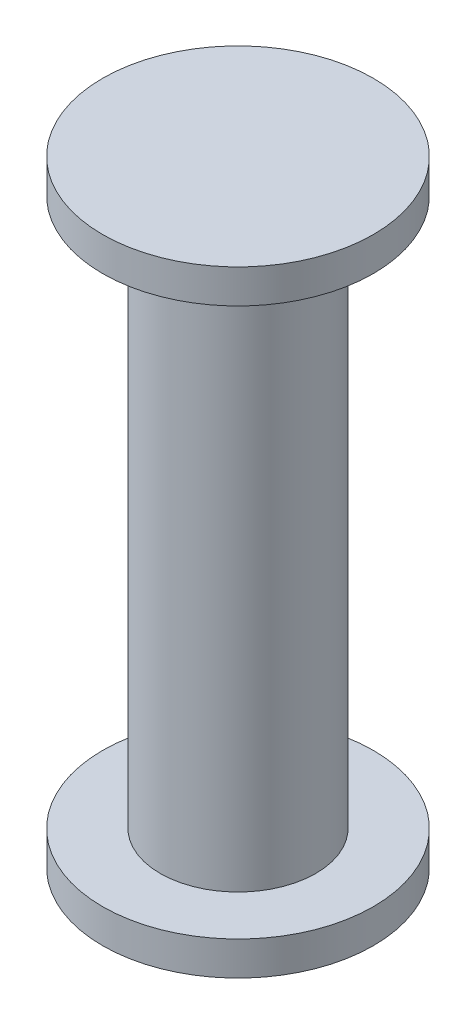
ISO-10303-21;
HEADER;
FILE_DESCRIPTION(('STEP AP214'),'2;1');
FILE_NAME('part.step','',(''),(''),'','','');
FILE_SCHEMA(('AUTOMOTIVE_DESIGN { 1 0 10303 214 1 1 1 1 }'));
ENDSEC;
DATA;
#1=APPLICATION_CONTEXT('core data for automotive mechanical design processes');
#2=APPLICATION_PROTOCOL_DEFINITION('international standard','automotive_design',2000,#1);
#3=PRODUCT_CONTEXT('',#1,'mechanical');
#4=PRODUCT('Part','Part','',(#3));
#5=PRODUCT_RELATED_PRODUCT_CATEGORY('part','',(#4));
#6=PRODUCT_DEFINITION_FORMATION('','',#4);
#7=PRODUCT_DEFINITION_CONTEXT('part definition',#1,'design');
#8=PRODUCT_DEFINITION('design','',#6,#7);
#9=PRODUCT_DEFINITION_SHAPE('','',#8);
#10=(LENGTH_UNIT() NAMED_UNIT(*) SI_UNIT(.MILLI.,.METRE.));
#11=(NAMED_UNIT(*) PLANE_ANGLE_UNIT() SI_UNIT($,.RADIAN.));
#12=(NAMED_UNIT(*) SI_UNIT($,.STERADIAN.) SOLID_ANGLE_UNIT());
#13=UNCERTAINTY_MEASURE_WITH_UNIT(LENGTH_MEASURE(1.E-05),#10,'distance_accuracy_value','');
#14=(GEOMETRIC_REPRESENTATION_CONTEXT(3) GLOBAL_UNCERTAINTY_ASSIGNED_CONTEXT((#13)) GLOBAL_UNIT_ASSIGNED_CONTEXT((#10,
#11,#12)) REPRESENTATION_CONTEXT('',''));
#15=CARTESIAN_POINT('',(0.,0.,0.));
#16=DIRECTION('',(0.,0.,1.));
#17=DIRECTION('',(1.,0.,0.));
#18=AXIS2_PLACEMENT_3D('',#15,#16,#17);
#19=CARTESIAN_POINT('',(0.,18.2,0.));
#20=DIRECTION('',(0.,-1.,0.));
#21=DIRECTION('',(0.,0.,-1.));
#22=AXIS2_PLACEMENT_3D('',#19,#20,#21);
#23=CYLINDRICAL_SURFACE('',#22,2.3);
#24=CARTESIAN_POINT('',(0.,1.,0.));
#25=DIRECTION('',(0.,1.,0.));
#26=DIRECTION('',(0.,0.,1.));
#27=AXIS2_PLACEMENT_3D('',#24,#25,#26);
#28=CIRCLE('',#27,2.3);
#29=CARTESIAN_POINT('',(0.,1.,2.3));
#30=VERTEX_POINT('',#29);
#31=EDGE_CURVE('E65',#30,#30,#28,.T.);
#32=ORIENTED_EDGE('',*,*,#31,.T.);
#33=EDGE_LOOP('',(#32));
#34=FACE_BOUND('',#33,.T.);
#35=CARTESIAN_POINT('',(0.,17.2,0.));
#36=DIRECTION('',(0.,1.,0.));
#37=DIRECTION('',(0.,0.,1.));
#38=AXIS2_PLACEMENT_3D('',#35,#36,#37);
#39=CIRCLE('',#38,2.3);
#40=CARTESIAN_POINT('',(0.,17.2,2.3));
#41=VERTEX_POINT('',#40);
#42=EDGE_CURVE('E10',#41,#41,#39,.T.);
#43=ORIENTED_EDGE('',*,*,#42,.F.);
#44=EDGE_LOOP('',(#43));
#45=FACE_BOUND('',#44,.T.);
#46=ADVANCED_FACE('F41',(#34,#45),#23,.T.);
#47=CARTESIAN_POINT('',(0.,17.2,0.));
#48=DIRECTION('',(0.,1.,0.));
#49=DIRECTION('',(0.,0.,1.));
#50=AXIS2_PLACEMENT_3D('',#47,#48,#49);
#51=CYLINDRICAL_SURFACE('',#50,4.);
#52=CARTESIAN_POINT('',(0.,17.2,0.));
#53=DIRECTION('',(0.,1.,0.));
#54=DIRECTION('',(0.,0.,1.));
#55=AXIS2_PLACEMENT_3D('',#52,#53,#54);
#56=CIRCLE('',#55,4.);
#57=CARTESIAN_POINT('',(0.,17.2,4.));
#58=VERTEX_POINT('',#57);
#59=EDGE_CURVE('E48',#58,#58,#56,.T.);
#60=ORIENTED_EDGE('',*,*,#59,.T.);
#61=EDGE_LOOP('',(#60));
#62=FACE_BOUND('',#61,.T.);
#63=CARTESIAN_POINT('',(0.,18.2,0.));
#64=DIRECTION('',(0.,1.,0.));
#65=DIRECTION('',(0.,0.,1.));
#66=AXIS2_PLACEMENT_3D('',#63,#64,#65);
#67=CIRCLE('',#66,4.);
#68=CARTESIAN_POINT('',(0.,18.2,4.));
#69=VERTEX_POINT('',#68);
#70=EDGE_CURVE('E53',#69,#69,#67,.T.);
#71=ORIENTED_EDGE('',*,*,#70,.F.);
#72=EDGE_LOOP('',(#71));
#73=FACE_BOUND('',#72,.T.);
#74=ADVANCED_FACE('F92',(#62,#73),#51,.T.);
#75=CARTESIAN_POINT('',(0.,17.2,0.));
#76=DIRECTION('',(0.,1.,0.));
#77=DIRECTION('',(0.,0.,1.));
#78=AXIS2_PLACEMENT_3D('',#75,#76,#77);
#79=PLANE('',#78);
#80=ORIENTED_EDGE('',*,*,#42,.T.);
#81=EDGE_LOOP('',(#80));
#82=FACE_BOUND('',#81,.T.);
#83=ORIENTED_EDGE('',*,*,#59,.F.);
#84=EDGE_LOOP('',(#83));
#85=FACE_BOUND('',#84,.T.);
#86=ADVANCED_FACE('F88',(#82,#85),#79,.F.);
#87=CARTESIAN_POINT('',(0.,18.2,0.));
#88=DIRECTION('',(0.,1.,0.));
#89=DIRECTION('',(0.,0.,1.));
#90=AXIS2_PLACEMENT_3D('',#87,#88,#89);
#91=PLANE('',#90);
#92=ORIENTED_EDGE('',*,*,#70,.T.);
#93=EDGE_LOOP('',(#92));
#94=FACE_BOUND('',#93,.T.);
#95=ADVANCED_FACE('F78',(#94),#91,.T.);
#96=CARTESIAN_POINT('',(0.,1.,0.));
#97=DIRECTION('',(0.,1.,0.));
#98=DIRECTION('',(0.,0.,1.));
#99=AXIS2_PLACEMENT_3D('',#96,#97,#98);
#100=PLANE('',#99);
#101=CARTESIAN_POINT('',(0.,1.,0.));
#102=DIRECTION('',(0.,1.,0.));
#103=DIRECTION('',(0.,0.,1.));
#104=AXIS2_PLACEMENT_3D('',#101,#102,#103);
#105=CIRCLE('',#104,4.);
#106=CARTESIAN_POINT('',(0.,1.,4.));
#107=VERTEX_POINT('',#106);
#108=EDGE_CURVE('E59',#107,#107,#105,.T.);
#109=ORIENTED_EDGE('',*,*,#108,.T.);
#110=EDGE_LOOP('',(#109));
#111=FACE_BOUND('',#110,.T.);
#112=ORIENTED_EDGE('',*,*,#31,.F.);
#113=EDGE_LOOP('',(#112));
#114=FACE_BOUND('',#113,.T.);
#115=ADVANCED_FACE('F75',(#111,#114),#100,.T.);
#116=CARTESIAN_POINT('',(0.,1.,0.));
#117=DIRECTION('',(0.,-1.,0.));
#118=DIRECTION('',(0.,0.,-1.));
#119=AXIS2_PLACEMENT_3D('',#116,#117,#118);
#120=CYLINDRICAL_SURFACE('',#119,4.);
#121=ORIENTED_EDGE('',*,*,#108,.F.);
#122=EDGE_LOOP('',(#121));
#123=FACE_BOUND('',#122,.T.);
#124=CARTESIAN_POINT('',(0.,0.,0.));
#125=DIRECTION('',(0.,1.,0.));
#126=DIRECTION('',(0.,0.,1.));
#127=AXIS2_PLACEMENT_3D('',#124,#125,#126);
#128=CIRCLE('',#127,4.);
#129=CARTESIAN_POINT('',(0.,0.,4.));
#130=VERTEX_POINT('',#129);
#131=EDGE_CURVE('E61',#130,#130,#128,.T.);
#132=ORIENTED_EDGE('',*,*,#131,.T.);
#133=EDGE_LOOP('',(#132));
#134=FACE_BOUND('',#133,.T.);
#135=ADVANCED_FACE('F77',(#123,#134),#120,.T.);
#136=CARTESIAN_POINT('',(0.,0.,0.));
#137=DIRECTION('',(0.,1.,0.));
#138=DIRECTION('',(0.,0.,1.));
#139=AXIS2_PLACEMENT_3D('',#136,#137,#138);
#140=PLANE('',#139);
#141=ORIENTED_EDGE('',*,*,#131,.F.);
#142=EDGE_LOOP('',(#141));
#143=FACE_BOUND('',#142,.T.);
#144=ADVANCED_FACE('F85',(#143),#140,.F.);
#145=CLOSED_SHELL('',(#46,#74,#86,#95,#115,#135,#144));
#146=MANIFOLD_SOLID_BREP('B2',#145);
#147=ADVANCED_BREP_SHAPE_REPRESENTATION('',(#18,#146),#14);
#148=SHAPE_DEFINITION_REPRESENTATION(#9,#147);
ENDSEC;
END-ISO-10303-21;
